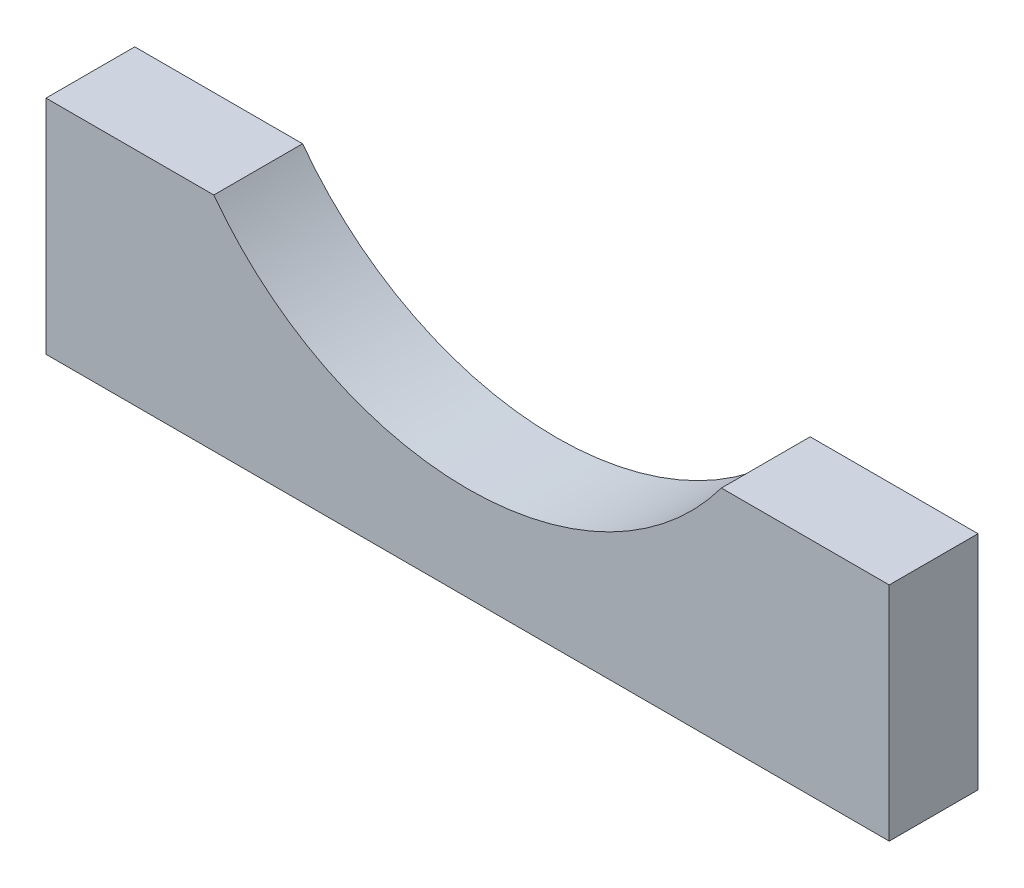
ISO-10303-21;
HEADER;
FILE_DESCRIPTION(('STEP AP214'),'2;1');
FILE_NAME('part.step','',(''),(''),'','','');
FILE_SCHEMA(('AUTOMOTIVE_DESIGN { 1 0 10303 214 1 1 1 1 }'));
ENDSEC;
DATA;
#1=APPLICATION_CONTEXT('core data for automotive mechanical design processes');
#2=APPLICATION_PROTOCOL_DEFINITION('international standard','automotive_design',2000,#1);
#3=PRODUCT_CONTEXT('',#1,'mechanical');
#4=PRODUCT('Part','Part','',(#3));
#5=PRODUCT_RELATED_PRODUCT_CATEGORY('part','',(#4));
#6=PRODUCT_DEFINITION_FORMATION('','',#4);
#7=PRODUCT_DEFINITION_CONTEXT('part definition',#1,'design');
#8=PRODUCT_DEFINITION('design','',#6,#7);
#9=PRODUCT_DEFINITION_SHAPE('','',#8);
#10=(LENGTH_UNIT() NAMED_UNIT(*) SI_UNIT(.MILLI.,.METRE.));
#11=(NAMED_UNIT(*) PLANE_ANGLE_UNIT() SI_UNIT($,.RADIAN.));
#12=(NAMED_UNIT(*) SI_UNIT($,.STERADIAN.) SOLID_ANGLE_UNIT());
#13=UNCERTAINTY_MEASURE_WITH_UNIT(LENGTH_MEASURE(1.E-05),#10,'distance_accuracy_value','');
#14=(GEOMETRIC_REPRESENTATION_CONTEXT(3) GLOBAL_UNCERTAINTY_ASSIGNED_CONTEXT((#13)) GLOBAL_UNIT_ASSIGNED_CONTEXT((#10,
#11,#12)) REPRESENTATION_CONTEXT('',''));
#15=CARTESIAN_POINT('',(0.,0.,0.));
#16=DIRECTION('',(0.,0.,1.));
#17=DIRECTION('',(1.,0.,0.));
#18=AXIS2_PLACEMENT_3D('',#15,#16,#17);
#19=CARTESIAN_POINT('',(38.,9.99999999999999,4.));
#20=DIRECTION('',(0.,-1.,0.));
#21=DIRECTION('',(1.,0.,0.));
#22=AXIS2_PLACEMENT_3D('',#19,#20,#21);
#23=PLANE('',#22);
#24=DIRECTION('',(-1.,0.,0.));
#25=VECTOR('',#24,1.);
#26=CARTESIAN_POINT('',(38.,9.99999999999999,0.));
#27=LINE('',#26,#25);
#28=CARTESIAN_POINT('',(38.,9.99999999999999,0.));
#29=VERTEX_POINT('',#28);
#30=CARTESIAN_POINT('',(30.4373292336979,10.,0.));
#31=VERTEX_POINT('',#30);
#32=EDGE_CURVE('E116',#29,#31,#27,.T.);
#33=ORIENTED_EDGE('',*,*,#32,.T.);
#34=DIRECTION('',(0.,0.,1.));
#35=VECTOR('',#34,1.);
#36=CARTESIAN_POINT('',(30.4373292336979,10.,-6.));
#37=LINE('',#36,#35);
#38=CARTESIAN_POINT('',(30.4373292336979,10.,4.));
#39=VERTEX_POINT('',#38);
#40=EDGE_CURVE('E48',#31,#39,#37,.T.);
#41=ORIENTED_EDGE('',*,*,#40,.T.);
#42=DIRECTION('',(-1.,0.,0.));
#43=VECTOR('',#42,1.);
#44=CARTESIAN_POINT('',(38.,9.99999999999999,4.));
#45=LINE('',#44,#43);
#46=CARTESIAN_POINT('',(38.,9.99999999999999,4.));
#47=VERTEX_POINT('',#46);
#48=EDGE_CURVE('E101',#47,#39,#45,.T.);
#49=ORIENTED_EDGE('',*,*,#48,.F.);
#50=DIRECTION('',(0.,0.,-1.));
#51=VECTOR('',#50,1.);
#52=CARTESIAN_POINT('',(38.,9.99999999999999,4.));
#53=LINE('',#52,#51);
#54=EDGE_CURVE('E115',#47,#29,#53,.T.);
#55=ORIENTED_EDGE('',*,*,#54,.T.);
#56=EDGE_LOOP('',(#33,#41,#49,#55));
#57=FACE_BOUND('',#56,.T.);
#58=ADVANCED_FACE('F33',(#57),#23,.F.);
#59=CARTESIAN_POINT('',(7.56267076630212,10.,4.));
#60=VERTEX_POINT('',#59);
#61=CARTESIAN_POINT('',(0.,10.,4.));
#62=VERTEX_POINT('',#61);
#63=EDGE_CURVE('E84',#60,#62,#45,.T.);
#64=ORIENTED_EDGE('',*,*,#63,.F.);
#65=DIRECTION('',(0.,0.,1.));
#66=VECTOR('',#65,1.);
#67=CARTESIAN_POINT('',(7.56267076630212,10.,-6.));
#68=LINE('',#67,#66);
#69=CARTESIAN_POINT('',(7.56267076630212,10.,0.));
#70=VERTEX_POINT('',#69);
#71=EDGE_CURVE('E93',#60,#70,#68,.F.);
#72=ORIENTED_EDGE('',*,*,#71,.T.);
#73=CARTESIAN_POINT('',(0.,10.,0.));
#74=VERTEX_POINT('',#73);
#75=EDGE_CURVE('E120',#70,#74,#27,.T.);
#76=ORIENTED_EDGE('',*,*,#75,.T.);
#77=DIRECTION('',(0.,0.,-1.));
#78=VECTOR('',#77,1.);
#79=CARTESIAN_POINT('',(0.,10.,4.));
#80=LINE('',#79,#78);
#81=EDGE_CURVE('E41',#62,#74,#80,.T.);
#82=ORIENTED_EDGE('',*,*,#81,.F.);
#83=EDGE_LOOP('',(#64,#72,#76,#82));
#84=FACE_BOUND('',#83,.T.);
#85=ADVANCED_FACE('F35',(#84),#23,.F.);
#86=CARTESIAN_POINT('',(0.,10.,4.));
#87=DIRECTION('',(1.,0.,0.));
#88=DIRECTION('',(0.,0.,-1.));
#89=AXIS2_PLACEMENT_3D('',#86,#87,#88);
#90=PLANE('',#89);
#91=DIRECTION('',(0.,-1.,0.));
#92=VECTOR('',#91,1.);
#93=CARTESIAN_POINT('',(0.,10.,0.));
#94=LINE('',#93,#92);
#95=CARTESIAN_POINT('',(0.,0.,0.));
#96=VERTEX_POINT('',#95);
#97=EDGE_CURVE('E119',#74,#96,#94,.T.);
#98=ORIENTED_EDGE('',*,*,#97,.T.);
#99=DIRECTION('',(0.,0.,-1.));
#100=VECTOR('',#99,1.);
#101=CARTESIAN_POINT('',(0.,0.,4.));
#102=LINE('',#101,#100);
#103=CARTESIAN_POINT('',(0.,0.,4.));
#104=VERTEX_POINT('',#103);
#105=EDGE_CURVE('E126',#104,#96,#102,.T.);
#106=ORIENTED_EDGE('',*,*,#105,.F.);
#107=DIRECTION('',(0.,-1.,0.));
#108=VECTOR('',#107,1.);
#109=CARTESIAN_POINT('',(0.,10.,4.));
#110=LINE('',#109,#108);
#111=EDGE_CURVE('E106',#62,#104,#110,.T.);
#112=ORIENTED_EDGE('',*,*,#111,.F.);
#113=ORIENTED_EDGE('',*,*,#81,.T.);
#114=EDGE_LOOP('',(#98,#106,#112,#113));
#115=FACE_BOUND('',#114,.T.);
#116=ADVANCED_FACE('F129',(#115),#90,.F.);
#117=CARTESIAN_POINT('',(0.,0.,4.));
#118=DIRECTION('',(0.,1.,0.));
#119=DIRECTION('',(0.,0.,1.));
#120=AXIS2_PLACEMENT_3D('',#117,#118,#119);
#121=PLANE('',#120);
#122=DIRECTION('',(1.,0.,0.));
#123=VECTOR('',#122,1.);
#124=CARTESIAN_POINT('',(0.,0.,0.));
#125=LINE('',#124,#123);
#126=CARTESIAN_POINT('',(38.,0.,0.));
#127=VERTEX_POINT('',#126);
#128=EDGE_CURVE('E107',#96,#127,#125,.T.);
#129=ORIENTED_EDGE('',*,*,#128,.T.);
#130=DIRECTION('',(0.,0.,-1.));
#131=VECTOR('',#130,1.);
#132=CARTESIAN_POINT('',(38.,0.,4.));
#133=LINE('',#132,#131);
#134=CARTESIAN_POINT('',(38.,0.,4.));
#135=VERTEX_POINT('',#134);
#136=EDGE_CURVE('E124',#135,#127,#133,.T.);
#137=ORIENTED_EDGE('',*,*,#136,.F.);
#138=DIRECTION('',(1.,0.,0.));
#139=VECTOR('',#138,1.);
#140=CARTESIAN_POINT('',(0.,0.,4.));
#141=LINE('',#140,#139);
#142=EDGE_CURVE('E112',#104,#135,#141,.T.);
#143=ORIENTED_EDGE('',*,*,#142,.F.);
#144=ORIENTED_EDGE('',*,*,#105,.T.);
#145=EDGE_LOOP('',(#129,#137,#143,#144));
#146=FACE_BOUND('',#145,.T.);
#147=ADVANCED_FACE('F135',(#146),#121,.F.);
#148=CARTESIAN_POINT('',(38.,0.,4.));
#149=DIRECTION('',(-1.,0.,0.));
#150=DIRECTION('',(0.,0.,1.));
#151=AXIS2_PLACEMENT_3D('',#148,#149,#150);
#152=PLANE('',#151);
#153=DIRECTION('',(0.,1.,0.));
#154=VECTOR('',#153,1.);
#155=CARTESIAN_POINT('',(38.,0.,0.));
#156=LINE('',#155,#154);
#157=EDGE_CURVE('E77',#127,#29,#156,.T.);
#158=ORIENTED_EDGE('',*,*,#157,.T.);
#159=ORIENTED_EDGE('',*,*,#54,.F.);
#160=DIRECTION('',(0.,1.,0.));
#161=VECTOR('',#160,1.);
#162=CARTESIAN_POINT('',(38.,0.,4.));
#163=LINE('',#162,#161);
#164=EDGE_CURVE('E56',#135,#47,#163,.T.);
#165=ORIENTED_EDGE('',*,*,#164,.F.);
#166=ORIENTED_EDGE('',*,*,#136,.T.);
#167=EDGE_LOOP('',(#158,#159,#165,#166));
#168=FACE_BOUND('',#167,.T.);
#169=ADVANCED_FACE('F137',(#168),#152,.F.);
#170=CARTESIAN_POINT('',(0.,0.,4.));
#171=DIRECTION('',(0.,0.,1.));
#172=DIRECTION('',(1.,0.,0.));
#173=AXIS2_PLACEMENT_3D('',#170,#171,#172);
#174=PLANE('',#173);
#175=CARTESIAN_POINT('',(19.,18.5,4.));
#176=DIRECTION('',(0.,0.,1.));
#177=DIRECTION('',(1.,0.,0.));
#178=AXIS2_PLACEMENT_3D('',#175,#176,#177);
#179=CIRCLE('',#178,14.25);
#180=EDGE_CURVE('E95',#60,#39,#179,.T.);
#181=ORIENTED_EDGE('',*,*,#180,.F.);
#182=ORIENTED_EDGE('',*,*,#63,.T.);
#183=ORIENTED_EDGE('',*,*,#111,.T.);
#184=ORIENTED_EDGE('',*,*,#142,.T.);
#185=ORIENTED_EDGE('',*,*,#164,.T.);
#186=ORIENTED_EDGE('',*,*,#48,.T.);
#187=EDGE_LOOP('',(#181,#182,#183,#184,#185,#186));
#188=FACE_BOUND('',#187,.T.);
#189=ADVANCED_FACE('F99',(#188),#174,.T.);
#190=CARTESIAN_POINT('',(0.,0.,0.));
#191=DIRECTION('',(0.,0.,1.));
#192=DIRECTION('',(1.,0.,0.));
#193=AXIS2_PLACEMENT_3D('',#190,#191,#192);
#194=PLANE('',#193);
#195=ORIENTED_EDGE('',*,*,#75,.F.);
#196=CARTESIAN_POINT('',(19.,18.5,0.));
#197=DIRECTION('',(0.,0.,1.));
#198=DIRECTION('',(1.,0.,0.));
#199=AXIS2_PLACEMENT_3D('',#196,#197,#198);
#200=CIRCLE('',#199,14.25);
#201=EDGE_CURVE('E11',#70,#31,#200,.T.);
#202=ORIENTED_EDGE('',*,*,#201,.T.);
#203=ORIENTED_EDGE('',*,*,#32,.F.);
#204=ORIENTED_EDGE('',*,*,#157,.F.);
#205=ORIENTED_EDGE('',*,*,#128,.F.);
#206=ORIENTED_EDGE('',*,*,#97,.F.);
#207=EDGE_LOOP('',(#195,#202,#203,#204,#205,#206));
#208=FACE_BOUND('',#207,.T.);
#209=ADVANCED_FACE('F141',(#208),#194,.F.);
#210=CARTESIAN_POINT('',(19.,18.5,-6.));
#211=DIRECTION('',(0.,0.,1.));
#212=DIRECTION('',(1.,0.,0.));
#213=AXIS2_PLACEMENT_3D('',#210,#211,#212);
#214=CYLINDRICAL_SURFACE('',#213,14.25);
#215=ORIENTED_EDGE('',*,*,#201,.F.);
#216=ORIENTED_EDGE('',*,*,#71,.F.);
#217=ORIENTED_EDGE('',*,*,#180,.T.);
#218=ORIENTED_EDGE('',*,*,#40,.F.);
#219=EDGE_LOOP('',(#215,#216,#217,#218));
#220=FACE_BOUND('',#219,.T.);
#221=ADVANCED_FACE('F94',(#220),#214,.F.);
#222=CLOSED_SHELL('',(#58,#85,#116,#147,#169,#189,#209,#221));
#223=MANIFOLD_SOLID_BREP('B2',#222);
#224=ADVANCED_BREP_SHAPE_REPRESENTATION('',(#18,#223),#14);
#225=SHAPE_DEFINITION_REPRESENTATION(#9,#224);
ENDSEC;
END-ISO-10303-21;
